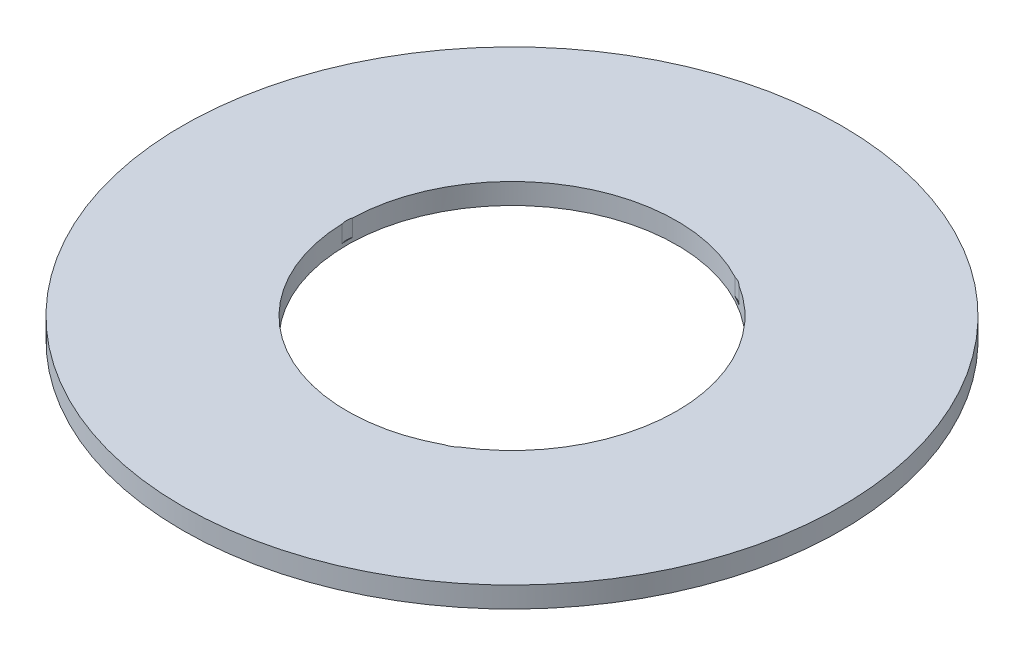
ISO-10303-21;
HEADER;
FILE_DESCRIPTION(('STEP AP214'),'2;1');
FILE_NAME('part.step','',(''),(''),'','','');
FILE_SCHEMA(('AUTOMOTIVE_DESIGN { 1 0 10303 214 1 1 1 1 }'));
ENDSEC;
DATA;
#1=APPLICATION_CONTEXT('core data for automotive mechanical design processes');
#2=APPLICATION_PROTOCOL_DEFINITION('international standard','automotive_design',2000,#1);
#3=PRODUCT_CONTEXT('',#1,'mechanical');
#4=PRODUCT('Part','Part','',(#3));
#5=PRODUCT_RELATED_PRODUCT_CATEGORY('part','',(#4));
#6=PRODUCT_DEFINITION_FORMATION('','',#4);
#7=PRODUCT_DEFINITION_CONTEXT('part definition',#1,'design');
#8=PRODUCT_DEFINITION('design','',#6,#7);
#9=PRODUCT_DEFINITION_SHAPE('','',#8);
#10=(LENGTH_UNIT() NAMED_UNIT(*) SI_UNIT(.MILLI.,.METRE.));
#11=(NAMED_UNIT(*) PLANE_ANGLE_UNIT() SI_UNIT($,.RADIAN.));
#12=(NAMED_UNIT(*) SI_UNIT($,.STERADIAN.) SOLID_ANGLE_UNIT());
#13=UNCERTAINTY_MEASURE_WITH_UNIT(LENGTH_MEASURE(1.E-05),#10,'distance_accuracy_value','');
#14=(GEOMETRIC_REPRESENTATION_CONTEXT(3) GLOBAL_UNCERTAINTY_ASSIGNED_CONTEXT((#13)) GLOBAL_UNIT_ASSIGNED_CONTEXT((#10,
#11,#12)) REPRESENTATION_CONTEXT('',''));
#15=CARTESIAN_POINT('',(0.,0.,0.));
#16=DIRECTION('',(0.,0.,1.));
#17=DIRECTION('',(1.,0.,0.));
#18=AXIS2_PLACEMENT_3D('',#15,#16,#17);
#19=CARTESIAN_POINT('',(0.,6.,0.));
#20=DIRECTION('',(0.,-1.,0.));
#21=DIRECTION('',(0.,0.,-1.));
#22=AXIS2_PLACEMENT_3D('',#19,#20,#21);
#23=CYLINDRICAL_SURFACE('',#22,95.);
#24=CARTESIAN_POINT('',(0.,6.,0.));
#25=DIRECTION('',(0.,1.,0.));
#26=DIRECTION('',(0.,0.,1.));
#27=AXIS2_PLACEMENT_3D('',#24,#25,#26);
#28=CIRCLE('',#27,95.);
#29=CARTESIAN_POINT('',(0.,6.,95.));
#30=VERTEX_POINT('',#29);
#31=EDGE_CURVE('E130',#30,#30,#28,.T.);
#32=ORIENTED_EDGE('',*,*,#31,.F.);
#33=EDGE_LOOP('',(#32));
#34=FACE_BOUND('',#33,.T.);
#35=CARTESIAN_POINT('',(0.,0.,0.));
#36=DIRECTION('',(0.,1.,0.));
#37=DIRECTION('',(0.,0.,1.));
#38=AXIS2_PLACEMENT_3D('',#35,#36,#37);
#39=CIRCLE('',#38,95.);
#40=CARTESIAN_POINT('',(0.,0.,95.));
#41=VERTEX_POINT('',#40);
#42=EDGE_CURVE('E117',#41,#41,#39,.T.);
#43=ORIENTED_EDGE('',*,*,#42,.T.);
#44=EDGE_LOOP('',(#43));
#45=FACE_BOUND('',#44,.T.);
#46=ADVANCED_FACE('F39',(#34,#45),#23,.T.);
#47=CARTESIAN_POINT('',(0.,6.,0.));
#48=DIRECTION('',(0.,1.,0.));
#49=DIRECTION('',(0.,0.,1.));
#50=AXIS2_PLACEMENT_3D('',#47,#48,#49);
#51=PLANE('',#50);
#52=CARTESIAN_POINT('',(21.0698264776708,6.,36.4940099659854));
#53=DIRECTION('',(0.,1.,0.));
#54=DIRECTION('',(0.866025403784436,0.,-0.500000000000004));
#55=AXIS2_PLACEMENT_3D('',#52,#53,#54);
#56=CIRCLE('',#55,5.5464091060029);
#57=CARTESIAN_POINT('',(22.4283155425999,6.,41.8714779046736));
#58=VERTEX_POINT('',#57);
#59=CARTESIAN_POINT('',(25.0476057881466,6.,40.3592299763215));
#60=VERTEX_POINT('',#59);
#61=EDGE_CURVE('E148',#58,#60,#56,.T.);
#62=ORIENTED_EDGE('',*,*,#61,.F.);
#63=CARTESIAN_POINT('',(0.,6.,0.));
#64=DIRECTION('',(0.,1.,0.));
#65=DIRECTION('',(0.,0.,1.));
#66=AXIS2_PLACEMENT_3D('',#63,#64,#65);
#67=CIRCLE('',#66,47.5);
#68=CARTESIAN_POINT('',(-47.4759213307461,6.,1.51224792835209));
#69=VERTEX_POINT('',#68);
#70=EDGE_CURVE('E113',#69,#58,#67,.T.);
#71=ORIENTED_EDGE('',*,*,#70,.F.);
#72=CARTESIAN_POINT('',(-42.1396529553412,6.,0.));
#73=DIRECTION('',(0.,1.,0.));
#74=DIRECTION('',(0.,0.,1.));
#75=AXIS2_PLACEMENT_3D('',#72,#73,#74);
#76=CIRCLE('',#75,5.5464091060029);
#77=CARTESIAN_POINT('',(-47.4759213307461,6.,-1.51224792835209));
#78=VERTEX_POINT('',#77);
#79=EDGE_CURVE('E125',#78,#69,#76,.T.);
#80=ORIENTED_EDGE('',*,*,#79,.F.);
#81=CARTESIAN_POINT('',(22.4283155425994,6.,-41.8714779046739));
#82=VERTEX_POINT('',#81);
#83=EDGE_CURVE('E107',#82,#78,#67,.T.);
#84=ORIENTED_EDGE('',*,*,#83,.F.);
#85=CARTESIAN_POINT('',(21.0698264776703,6.,-36.4940099659857));
#86=DIRECTION('',(0.,1.,0.));
#87=DIRECTION('',(-0.866025403784443,0.,-0.499999999999992));
#88=AXIS2_PLACEMENT_3D('',#85,#86,#87);
#89=CIRCLE('',#88,5.5464091060029);
#90=CARTESIAN_POINT('',(25.047605788146,6.,-40.3592299763218));
#91=VERTEX_POINT('',#90);
#92=EDGE_CURVE('E95',#91,#82,#89,.T.);
#93=ORIENTED_EDGE('',*,*,#92,.F.);
#94=EDGE_CURVE('E106',#60,#91,#67,.T.);
#95=ORIENTED_EDGE('',*,*,#94,.F.);
#96=EDGE_LOOP('',(#62,#71,#80,#84,#93,#95));
#97=FACE_BOUND('',#96,.T.);
#98=ORIENTED_EDGE('',*,*,#31,.T.);
#99=EDGE_LOOP('',(#98));
#100=FACE_BOUND('',#99,.T.);
#101=ADVANCED_FACE('F102',(#97,#100),#51,.T.);
#102=CARTESIAN_POINT('',(0.,0.,0.));
#103=DIRECTION('',(0.,1.,0.));
#104=DIRECTION('',(0.,0.,1.));
#105=AXIS2_PLACEMENT_3D('',#102,#103,#104);
#106=PLANE('',#105);
#107=CARTESIAN_POINT('',(0.,0.,0.));
#108=DIRECTION('',(0.,1.,0.));
#109=DIRECTION('',(0.,0.,1.));
#110=AXIS2_PLACEMENT_3D('',#107,#108,#109);
#111=CIRCLE('',#110,47.5);
#112=CARTESIAN_POINT('',(0.,0.,47.5));
#113=VERTEX_POINT('',#112);
#114=EDGE_CURVE('E118',#113,#113,#111,.T.);
#115=ORIENTED_EDGE('',*,*,#114,.T.);
#116=EDGE_LOOP('',(#115));
#117=FACE_BOUND('',#116,.T.);
#118=ORIENTED_EDGE('',*,*,#42,.F.);
#119=EDGE_LOOP('',(#118));
#120=FACE_BOUND('',#119,.T.);
#121=ADVANCED_FACE('F161',(#117,#120),#106,.F.);
#122=CARTESIAN_POINT('',(0.,6.,0.));
#123=DIRECTION('',(0.,-1.,0.));
#124=DIRECTION('',(0.,0.,-1.));
#125=AXIS2_PLACEMENT_3D('',#122,#123,#124);
#126=CYLINDRICAL_SURFACE('',#125,47.5);
#127=DIRECTION('',(0.,1.,0.));
#128=VECTOR('',#127,1.);
#129=CARTESIAN_POINT('',(22.4283155425999,3.56933312547554,41.8714779046736));
#130=LINE('',#129,#128);
#131=CARTESIAN_POINT('',(22.4283155425999,1.13866625095107,41.8714779046736));
#132=VERTEX_POINT('',#131);
#133=EDGE_CURVE('E11',#132,#58,#130,.T.);
#134=ORIENTED_EDGE('',*,*,#133,.F.);
#135=CARTESIAN_POINT('',(0.,1.13866625095107,0.));
#136=DIRECTION('',(0.,1.,0.));
#137=DIRECTION('',(0.,0.,1.));
#138=AXIS2_PLACEMENT_3D('',#135,#136,#137);
#139=CIRCLE('',#138,47.5);
#140=CARTESIAN_POINT('',(25.0476057881466,1.13866625095107,40.3592299763215));
#141=VERTEX_POINT('',#140);
#142=EDGE_CURVE('E100',#132,#141,#139,.T.);
#143=ORIENTED_EDGE('',*,*,#142,.T.);
#144=DIRECTION('',(0.,1.,0.));
#145=VECTOR('',#144,1.);
#146=CARTESIAN_POINT('',(25.0476057881466,3.56933312547554,40.3592299763214));
#147=LINE('',#146,#145);
#148=EDGE_CURVE('E46',#60,#141,#147,.F.);
#149=ORIENTED_EDGE('',*,*,#148,.F.);
#150=ORIENTED_EDGE('',*,*,#94,.T.);
#151=DIRECTION('',(0.,1.,0.));
#152=VECTOR('',#151,1.);
#153=CARTESIAN_POINT('',(25.047605788146,3.56933312547554,-40.3592299763218));
#154=LINE('',#153,#152);
#155=CARTESIAN_POINT('',(25.047605788146,1.13866625095107,-40.3592299763218));
#156=VERTEX_POINT('',#155);
#157=EDGE_CURVE('E90',#156,#91,#154,.T.);
#158=ORIENTED_EDGE('',*,*,#157,.F.);
#159=CARTESIAN_POINT('',(0.,1.13866625095107,0.));
#160=DIRECTION('',(0.,1.,0.));
#161=DIRECTION('',(0.,0.,1.));
#162=AXIS2_PLACEMENT_3D('',#159,#160,#161);
#163=CIRCLE('',#162,47.5);
#164=CARTESIAN_POINT('',(22.4283155425994,1.13866625095107,-41.8714779046739));
#165=VERTEX_POINT('',#164);
#166=EDGE_CURVE('E143',#156,#165,#163,.T.);
#167=ORIENTED_EDGE('',*,*,#166,.T.);
#168=DIRECTION('',(0.,1.,0.));
#169=VECTOR('',#168,1.);
#170=CARTESIAN_POINT('',(22.4283155425993,3.56933312547554,-41.8714779046739));
#171=LINE('',#170,#169);
#172=EDGE_CURVE('E98',#82,#165,#171,.F.);
#173=ORIENTED_EDGE('',*,*,#172,.F.);
#174=ORIENTED_EDGE('',*,*,#83,.T.);
#175=DIRECTION('',(0.,1.,0.));
#176=VECTOR('',#175,1.);
#177=CARTESIAN_POINT('',(-47.4759213307461,3.56933312547554,-1.51224792835217));
#178=LINE('',#177,#176);
#179=CARTESIAN_POINT('',(-47.4759213307461,1.13866625095107,-1.51224792835209));
#180=VERTEX_POINT('',#179);
#181=EDGE_CURVE('E137',#180,#78,#178,.T.);
#182=ORIENTED_EDGE('',*,*,#181,.F.);
#183=CARTESIAN_POINT('',(0.,1.13866625095107,0.));
#184=DIRECTION('',(0.,1.,0.));
#185=DIRECTION('',(0.,0.,1.));
#186=AXIS2_PLACEMENT_3D('',#183,#184,#185);
#187=CIRCLE('',#186,47.5);
#188=CARTESIAN_POINT('',(-47.4759213307461,1.13866625095107,1.51224792835209));
#189=VERTEX_POINT('',#188);
#190=EDGE_CURVE('E128',#180,#189,#187,.T.);
#191=ORIENTED_EDGE('',*,*,#190,.T.);
#192=DIRECTION('',(0.,1.,0.));
#193=VECTOR('',#192,1.);
#194=CARTESIAN_POINT('',(-47.4759213307461,3.56933312547554,1.51224792835217));
#195=LINE('',#194,#193);
#196=EDGE_CURVE('E134',#69,#189,#195,.F.);
#197=ORIENTED_EDGE('',*,*,#196,.F.);
#198=ORIENTED_EDGE('',*,*,#70,.T.);
#199=EDGE_LOOP('',(#134,#143,#149,#150,#158,#167,#173,#174,#182,#191,#197,#198));
#200=FACE_BOUND('',#199,.T.);
#201=ORIENTED_EDGE('',*,*,#114,.F.);
#202=EDGE_LOOP('',(#201));
#203=FACE_BOUND('',#202,.T.);
#204=ADVANCED_FACE('F115',(#200,#203),#126,.F.);
#205=CARTESIAN_POINT('',(-42.1396529553412,1.13866625095107,0.));
#206=DIRECTION('',(0.,1.,0.));
#207=DIRECTION('',(0.,0.,1.));
#208=AXIS2_PLACEMENT_3D('',#205,#206,#207);
#209=CYLINDRICAL_SURFACE('',#208,5.5464091060029);
#210=ORIENTED_EDGE('',*,*,#181,.T.);
#211=ORIENTED_EDGE('',*,*,#79,.T.);
#212=ORIENTED_EDGE('',*,*,#196,.T.);
#213=CARTESIAN_POINT('',(-42.1396529553412,1.13866625095107,0.));
#214=DIRECTION('',(0.,1.,0.));
#215=DIRECTION('',(0.,0.,1.));
#216=AXIS2_PLACEMENT_3D('',#213,#214,#215);
#217=CIRCLE('',#216,5.5464091060029);
#218=EDGE_CURVE('E127',#180,#189,#217,.T.);
#219=ORIENTED_EDGE('',*,*,#218,.F.);
#220=EDGE_LOOP('',(#210,#211,#212,#219));
#221=FACE_BOUND('',#220,.T.);
#222=ADVANCED_FACE('F175',(#221),#209,.F.);
#223=CARTESIAN_POINT('',(-42.1396529553412,1.13866625095107,0.));
#224=DIRECTION('',(0.,1.,0.));
#225=DIRECTION('',(0.,0.,1.));
#226=AXIS2_PLACEMENT_3D('',#223,#224,#225);
#227=PLANE('',#226);
#228=ORIENTED_EDGE('',*,*,#218,.T.);
#229=ORIENTED_EDGE('',*,*,#190,.F.);
#230=EDGE_LOOP('',(#228,#229));
#231=FACE_BOUND('',#230,.T.);
#232=ADVANCED_FACE('F176',(#231),#227,.T.);
#233=CARTESIAN_POINT('',(21.0698264776703,1.13866625095107,-36.4940099659857));
#234=DIRECTION('',(0.,1.,0.));
#235=DIRECTION('',(0.,0.,1.));
#236=AXIS2_PLACEMENT_3D('',#233,#234,#235);
#237=CYLINDRICAL_SURFACE('',#236,5.5464091060029);
#238=ORIENTED_EDGE('',*,*,#157,.T.);
#239=ORIENTED_EDGE('',*,*,#92,.T.);
#240=ORIENTED_EDGE('',*,*,#172,.T.);
#241=CARTESIAN_POINT('',(21.0698264776703,1.13866625095107,-36.4940099659857));
#242=DIRECTION('',(0.,1.,0.));
#243=DIRECTION('',(-0.866025403784443,0.,-0.499999999999992));
#244=AXIS2_PLACEMENT_3D('',#241,#242,#243);
#245=CIRCLE('',#244,5.5464091060029);
#246=EDGE_CURVE('E56',#156,#165,#245,.T.);
#247=ORIENTED_EDGE('',*,*,#246,.F.);
#248=EDGE_LOOP('',(#238,#239,#240,#247));
#249=FACE_BOUND('',#248,.T.);
#250=ADVANCED_FACE('F93',(#249),#237,.F.);
#251=CARTESIAN_POINT('',(21.0698264776703,1.13866625095107,-36.4940099659857));
#252=DIRECTION('',(0.,1.,0.));
#253=DIRECTION('',(-0.866025403784443,0.,-0.499999999999992));
#254=AXIS2_PLACEMENT_3D('',#251,#252,#253);
#255=PLANE('',#254);
#256=ORIENTED_EDGE('',*,*,#246,.T.);
#257=ORIENTED_EDGE('',*,*,#166,.F.);
#258=EDGE_LOOP('',(#256,#257));
#259=FACE_BOUND('',#258,.T.);
#260=ADVANCED_FACE('F153',(#259),#255,.T.);
#261=CARTESIAN_POINT('',(21.0698264776708,1.13866625095107,36.4940099659854));
#262=DIRECTION('',(0.,1.,0.));
#263=DIRECTION('',(0.,0.,1.));
#264=AXIS2_PLACEMENT_3D('',#261,#262,#263);
#265=CYLINDRICAL_SURFACE('',#264,5.5464091060029);
#266=ORIENTED_EDGE('',*,*,#133,.T.);
#267=ORIENTED_EDGE('',*,*,#61,.T.);
#268=ORIENTED_EDGE('',*,*,#148,.T.);
#269=CARTESIAN_POINT('',(21.0698264776708,1.13866625095107,36.4940099659854));
#270=DIRECTION('',(0.,1.,0.));
#271=DIRECTION('',(0.866025403784436,0.,-0.500000000000004));
#272=AXIS2_PLACEMENT_3D('',#269,#270,#271);
#273=CIRCLE('',#272,5.5464091060029);
#274=EDGE_CURVE('E55',#132,#141,#273,.T.);
#275=ORIENTED_EDGE('',*,*,#274,.F.);
#276=EDGE_LOOP('',(#266,#267,#268,#275));
#277=FACE_BOUND('',#276,.T.);
#278=ADVANCED_FACE('F144',(#277),#265,.F.);
#279=CARTESIAN_POINT('',(21.0698264776708,1.13866625095107,36.4940099659854));
#280=DIRECTION('',(0.,1.,0.));
#281=DIRECTION('',(0.866025403784436,0.,-0.500000000000004));
#282=AXIS2_PLACEMENT_3D('',#279,#280,#281);
#283=PLANE('',#282);
#284=ORIENTED_EDGE('',*,*,#274,.T.);
#285=ORIENTED_EDGE('',*,*,#142,.F.);
#286=EDGE_LOOP('',(#284,#285));
#287=FACE_BOUND('',#286,.T.);
#288=ADVANCED_FACE('F150',(#287),#283,.T.);
#289=CLOSED_SHELL('',(#46,#101,#121,#204,#222,#232,#250,#260,#278,#288));
#290=MANIFOLD_SOLID_BREP('B2',#289);
#291=ADVANCED_BREP_SHAPE_REPRESENTATION('',(#18,#290),#14);
#292=SHAPE_DEFINITION_REPRESENTATION(#9,#291);
ENDSEC;
END-ISO-10303-21;
